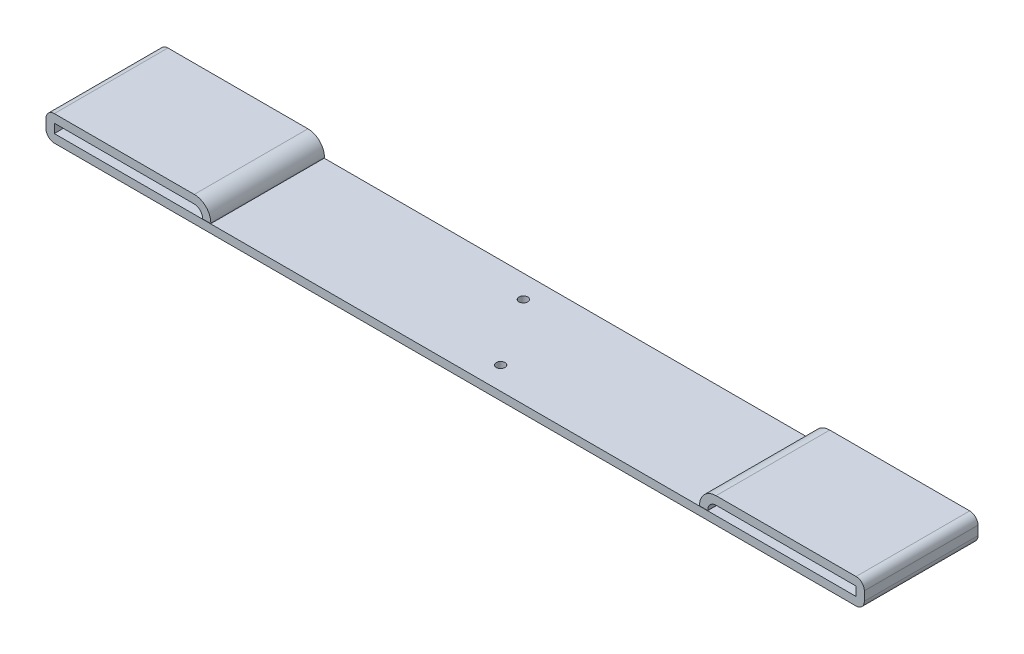
ISO-10303-21;
HEADER;
FILE_DESCRIPTION(('STEP AP214'),'2;1');
FILE_NAME('part.step','',(''),(''),'','','');
FILE_SCHEMA(('AUTOMOTIVE_DESIGN { 1 0 10303 214 1 1 1 1 }'));
ENDSEC;
DATA;
#1=APPLICATION_CONTEXT('core data for automotive mechanical design processes');
#2=APPLICATION_PROTOCOL_DEFINITION('international standard','automotive_design',2000,#1);
#3=PRODUCT_CONTEXT('',#1,'mechanical');
#4=PRODUCT('Part','Part','',(#3));
#5=PRODUCT_RELATED_PRODUCT_CATEGORY('part','',(#4));
#6=PRODUCT_DEFINITION_FORMATION('','',#4);
#7=PRODUCT_DEFINITION_CONTEXT('part definition',#1,'design');
#8=PRODUCT_DEFINITION('design','',#6,#7);
#9=PRODUCT_DEFINITION_SHAPE('','',#8);
#10=(LENGTH_UNIT() NAMED_UNIT(*) SI_UNIT(.MILLI.,.METRE.));
#11=(NAMED_UNIT(*) PLANE_ANGLE_UNIT() SI_UNIT($,.RADIAN.));
#12=(NAMED_UNIT(*) SI_UNIT($,.STERADIAN.) SOLID_ANGLE_UNIT());
#13=UNCERTAINTY_MEASURE_WITH_UNIT(LENGTH_MEASURE(1.E-05),#10,'distance_accuracy_value','');
#14=(GEOMETRIC_REPRESENTATION_CONTEXT(3) GLOBAL_UNCERTAINTY_ASSIGNED_CONTEXT((#13)) GLOBAL_UNIT_ASSIGNED_CONTEXT((#10,
#11,#12)) REPRESENTATION_CONTEXT('',''));
#15=CARTESIAN_POINT('',(0.,0.,0.));
#16=DIRECTION('',(0.,0.,1.));
#17=DIRECTION('',(1.,0.,0.));
#18=AXIS2_PLACEMENT_3D('',#15,#16,#17);
#19=CARTESIAN_POINT('',(-138.8364,0.1397,0.));
#20=DIRECTION('',(0.,1.,0.));
#21=DIRECTION('',(0.,0.,1.));
#22=AXIS2_PLACEMENT_3D('',#19,#20,#21);
#23=PLANE('',#22);
#24=DIRECTION('',(0.,0.,1.));
#25=VECTOR('',#24,1.);
#26=CARTESIAN_POINT('',(-141.1478,0.1397,-31.75));
#27=LINE('',#26,#25);
#28=CARTESIAN_POINT('',(-141.1478,0.1397,-31.75));
#29=VERTEX_POINT('',#28);
#30=CARTESIAN_POINT('',(-141.1478,0.1397,31.75));
#31=VERTEX_POINT('',#30);
#32=EDGE_CURVE('E185',#29,#31,#27,.T.);
#33=ORIENTED_EDGE('',*,*,#32,.F.);
#34=DIRECTION('',(1.,0.,0.));
#35=VECTOR('',#34,1.);
#36=CARTESIAN_POINT('',(-138.8364,0.1397,-31.75));
#37=LINE('',#36,#35);
#38=CARTESIAN_POINT('',(-136.525,0.1397,-31.75));
#39=VERTEX_POINT('',#38);
#40=EDGE_CURVE('E212',#39,#29,#37,.F.);
#41=ORIENTED_EDGE('',*,*,#40,.F.);
#42=DIRECTION('',(0.,0.,1.));
#43=VECTOR('',#42,1.);
#44=CARTESIAN_POINT('',(-136.525,0.1397,-31.75));
#45=LINE('',#44,#43);
#46=CARTESIAN_POINT('',(-136.525,0.1397,31.75));
#47=VERTEX_POINT('',#46);
#48=EDGE_CURVE('E179',#39,#47,#45,.T.);
#49=ORIENTED_EDGE('',*,*,#48,.T.);
#50=DIRECTION('',(1.,0.,0.));
#51=VECTOR('',#50,1.);
#52=CARTESIAN_POINT('',(-138.8364,0.1397,31.75));
#53=LINE('',#52,#51);
#54=EDGE_CURVE('E207',#31,#47,#53,.T.);
#55=ORIENTED_EDGE('',*,*,#54,.F.);
#56=EDGE_LOOP('',(#33,#41,#49,#55));
#57=FACE_BOUND('',#56,.T.);
#58=ADVANCED_FACE('F16',(#57),#23,.F.);
#59=CARTESIAN_POINT('',(138.8364,0.1397,0.));
#60=DIRECTION('',(0.,1.,0.));
#61=DIRECTION('',(0.,0.,1.));
#62=AXIS2_PLACEMENT_3D('',#59,#60,#61);
#63=PLANE('',#62);
#64=DIRECTION('',(0.,0.,-1.));
#65=VECTOR('',#64,1.);
#66=CARTESIAN_POINT('',(141.1478,0.1397,31.75));
#67=LINE('',#66,#65);
#68=CARTESIAN_POINT('',(141.1478,0.1397,31.75));
#69=VERTEX_POINT('',#68);
#70=CARTESIAN_POINT('',(141.1478,0.1397,-31.75));
#71=VERTEX_POINT('',#70);
#72=EDGE_CURVE('E144',#69,#71,#67,.T.);
#73=ORIENTED_EDGE('',*,*,#72,.F.);
#74=DIRECTION('',(1.,0.,0.));
#75=VECTOR('',#74,1.);
#76=CARTESIAN_POINT('',(138.8364,0.1397,31.75));
#77=LINE('',#76,#75);
#78=CARTESIAN_POINT('',(136.525,0.1397,31.75));
#79=VERTEX_POINT('',#78);
#80=EDGE_CURVE('E201',#79,#69,#77,.T.);
#81=ORIENTED_EDGE('',*,*,#80,.F.);
#82=DIRECTION('',(0.,0.,-1.));
#83=VECTOR('',#82,1.);
#84=CARTESIAN_POINT('',(136.525,0.1397,31.75));
#85=LINE('',#84,#83);
#86=CARTESIAN_POINT('',(136.525,0.1397,-31.75));
#87=VERTEX_POINT('',#86);
#88=EDGE_CURVE('E192',#79,#87,#85,.T.);
#89=ORIENTED_EDGE('',*,*,#88,.T.);
#90=DIRECTION('',(1.,0.,0.));
#91=VECTOR('',#90,1.);
#92=CARTESIAN_POINT('',(138.8364,0.1397,-31.75));
#93=LINE('',#92,#91);
#94=EDGE_CURVE('E193',#71,#87,#93,.F.);
#95=ORIENTED_EDGE('',*,*,#94,.F.);
#96=EDGE_LOOP('',(#73,#81,#89,#95));
#97=FACE_BOUND('',#96,.T.);
#98=ADVANCED_FACE('F369',(#97),#63,.F.);
#99=CARTESIAN_POINT('',(136.525,0.4191,31.75));
#100=DIRECTION('',(1.,0.,0.));
#101=DIRECTION('',(0.,0.,-1.));
#102=AXIS2_PLACEMENT_3D('',#99,#100,#101);
#103=PLANE('',#102);
#104=DIRECTION('',(0.,1.,0.));
#105=VECTOR('',#104,1.);
#106=CARTESIAN_POINT('',(136.525,0.4191,-31.75));
#107=LINE('',#106,#105);
#108=CARTESIAN_POINT('',(136.525,0.4191,-31.75));
#109=VERTEX_POINT('',#108);
#110=EDGE_CURVE('E138',#87,#109,#107,.T.);
#111=ORIENTED_EDGE('',*,*,#110,.F.);
#112=ORIENTED_EDGE('',*,*,#88,.F.);
#113=DIRECTION('',(0.,1.,0.));
#114=VECTOR('',#113,1.);
#115=CARTESIAN_POINT('',(136.525,0.4191,31.75));
#116=LINE('',#115,#114);
#117=CARTESIAN_POINT('',(136.525,0.4191,31.75));
#118=VERTEX_POINT('',#117);
#119=EDGE_CURVE('E189',#118,#79,#116,.F.);
#120=ORIENTED_EDGE('',*,*,#119,.F.);
#121=DIRECTION('',(0.,0.,-1.));
#122=VECTOR('',#121,1.);
#123=CARTESIAN_POINT('',(136.525,0.4191,31.75));
#124=LINE('',#123,#122);
#125=EDGE_CURVE('E143',#109,#118,#124,.F.);
#126=ORIENTED_EDGE('',*,*,#125,.F.);
#127=EDGE_LOOP('',(#111,#112,#120,#126));
#128=FACE_BOUND('',#127,.T.);
#129=ADVANCED_FACE('F371',(#128),#103,.F.);
#130=CARTESIAN_POINT('',(-136.525,0.4191,-31.75));
#131=DIRECTION('',(-1.,0.,0.));
#132=DIRECTION('',(0.,0.,1.));
#133=AXIS2_PLACEMENT_3D('',#130,#131,#132);
#134=PLANE('',#133);
#135=DIRECTION('',(0.,1.,0.));
#136=VECTOR('',#135,1.);
#137=CARTESIAN_POINT('',(-136.525,0.4191,31.75));
#138=LINE('',#137,#136);
#139=CARTESIAN_POINT('',(-136.525,0.4191,31.75));
#140=VERTEX_POINT('',#139);
#141=EDGE_CURVE('E182',#47,#140,#138,.T.);
#142=ORIENTED_EDGE('',*,*,#141,.F.);
#143=ORIENTED_EDGE('',*,*,#48,.F.);
#144=DIRECTION('',(0.,1.,0.));
#145=VECTOR('',#144,1.);
#146=CARTESIAN_POINT('',(-136.525,0.4191,-31.75));
#147=LINE('',#146,#145);
#148=CARTESIAN_POINT('',(-136.525,0.4191,-31.75));
#149=VERTEX_POINT('',#148);
#150=EDGE_CURVE('E176',#149,#39,#147,.F.);
#151=ORIENTED_EDGE('',*,*,#150,.F.);
#152=DIRECTION('',(0.,0.,1.));
#153=VECTOR('',#152,1.);
#154=CARTESIAN_POINT('',(-136.525,0.4191,-31.75));
#155=LINE('',#154,#153);
#156=EDGE_CURVE('E171',#140,#149,#155,.F.);
#157=ORIENTED_EDGE('',*,*,#156,.F.);
#158=EDGE_LOOP('',(#142,#143,#151,#157));
#159=FACE_BOUND('',#158,.T.);
#160=ADVANCED_FACE('F310',(#159),#134,.F.);
#161=CARTESIAN_POINT('',(-141.1478,0.4191,-31.75));
#162=DIRECTION('',(-1.,0.,0.));
#163=DIRECTION('',(0.,0.,1.));
#164=AXIS2_PLACEMENT_3D('',#161,#162,#163);
#165=PLANE('',#164);
#166=DIRECTION('',(0.,0.,1.));
#167=VECTOR('',#166,1.);
#168=CARTESIAN_POINT('',(-141.1478,0.4191,-31.75));
#169=LINE('',#168,#167);
#170=CARTESIAN_POINT('',(-141.1478,0.4191,31.75));
#171=VERTEX_POINT('',#170);
#172=CARTESIAN_POINT('',(-141.1478,0.4191,-31.75));
#173=VERTEX_POINT('',#172);
#174=EDGE_CURVE('E166',#171,#173,#169,.F.);
#175=ORIENTED_EDGE('',*,*,#174,.T.);
#176=DIRECTION('',(0.,1.,0.));
#177=VECTOR('',#176,1.);
#178=CARTESIAN_POINT('',(-141.1478,0.2794,-31.75));
#179=LINE('',#178,#177);
#180=EDGE_CURVE('E213',#173,#29,#179,.F.);
#181=ORIENTED_EDGE('',*,*,#180,.T.);
#182=ORIENTED_EDGE('',*,*,#32,.T.);
#183=DIRECTION('',(0.,1.,0.));
#184=VECTOR('',#183,1.);
#185=CARTESIAN_POINT('',(-141.1478,0.2794,31.75));
#186=LINE('',#185,#184);
#187=EDGE_CURVE('E210',#31,#171,#186,.T.);
#188=ORIENTED_EDGE('',*,*,#187,.T.);
#189=EDGE_LOOP('',(#175,#181,#182,#188));
#190=FACE_BOUND('',#189,.T.);
#191=ADVANCED_FACE('F574',(#190),#165,.T.);
#192=CARTESIAN_POINT('',(141.1478,0.4191,31.75));
#193=DIRECTION('',(1.,0.,0.));
#194=DIRECTION('',(0.,0.,-1.));
#195=AXIS2_PLACEMENT_3D('',#192,#193,#194);
#196=PLANE('',#195);
#197=DIRECTION('',(0.,0.,-1.));
#198=VECTOR('',#197,1.);
#199=CARTESIAN_POINT('',(141.1478,0.4191,31.75));
#200=LINE('',#199,#198);
#201=CARTESIAN_POINT('',(141.1478,0.4191,-31.75));
#202=VERTEX_POINT('',#201);
#203=CARTESIAN_POINT('',(141.1478,0.4191,31.75));
#204=VERTEX_POINT('',#203);
#205=EDGE_CURVE('E157',#202,#204,#200,.F.);
#206=ORIENTED_EDGE('',*,*,#205,.T.);
#207=DIRECTION('',(0.,1.,0.));
#208=VECTOR('',#207,1.);
#209=CARTESIAN_POINT('',(141.1478,0.2794,31.75));
#210=LINE('',#209,#208);
#211=EDGE_CURVE('E202',#204,#69,#210,.F.);
#212=ORIENTED_EDGE('',*,*,#211,.T.);
#213=ORIENTED_EDGE('',*,*,#72,.T.);
#214=DIRECTION('',(0.,1.,0.));
#215=VECTOR('',#214,1.);
#216=CARTESIAN_POINT('',(141.1478,0.2794,-31.75));
#217=LINE('',#216,#215);
#218=EDGE_CURVE('E199',#71,#202,#217,.T.);
#219=ORIENTED_EDGE('',*,*,#218,.T.);
#220=EDGE_LOOP('',(#206,#212,#213,#219));
#221=FACE_BOUND('',#220,.T.);
#222=ADVANCED_FACE('F362',(#221),#196,.T.);
#223=CARTESIAN_POINT('',(145.7706,0.4191,31.75));
#224=DIRECTION('',(0.,0.,-1.));
#225=DIRECTION('',(-1.,0.,0.));
#226=AXIS2_PLACEMENT_3D('',#223,#224,#225);
#227=CYLINDRICAL_SURFACE('',#226,9.2456);
#228=ORIENTED_EDGE('',*,*,#125,.T.);
#229=CARTESIAN_POINT('',(145.7706,0.4191,31.75));
#230=DIRECTION('',(0.,0.,-1.));
#231=DIRECTION('',(-1.,0.,0.));
#232=AXIS2_PLACEMENT_3D('',#229,#230,#231);
#233=CIRCLE('',#232,9.2456);
#234=CARTESIAN_POINT('',(145.7706,9.6647,31.75));
#235=VERTEX_POINT('',#234);
#236=EDGE_CURVE('E156',#118,#235,#233,.T.);
#237=ORIENTED_EDGE('',*,*,#236,.T.);
#238=DIRECTION('',(0.,0.,-1.));
#239=VECTOR('',#238,1.);
#240=CARTESIAN_POINT('',(145.7706,9.6647,31.75));
#241=LINE('',#240,#239);
#242=CARTESIAN_POINT('',(145.7706,9.6647,-31.75));
#243=VERTEX_POINT('',#242);
#244=EDGE_CURVE('E148',#235,#243,#241,.T.);
#245=ORIENTED_EDGE('',*,*,#244,.T.);
#246=CARTESIAN_POINT('',(145.7706,0.4191,-31.75));
#247=DIRECTION('',(0.,0.,-1.));
#248=DIRECTION('',(-1.,0.,0.));
#249=AXIS2_PLACEMENT_3D('',#246,#247,#248);
#250=CIRCLE('',#249,9.2456);
#251=EDGE_CURVE('E19',#243,#109,#250,.F.);
#252=ORIENTED_EDGE('',*,*,#251,.T.);
#253=EDGE_LOOP('',(#228,#237,#245,#252));
#254=FACE_BOUND('',#253,.T.);
#255=ADVANCED_FACE('F154',(#254),#227,.T.);
#256=CARTESIAN_POINT('',(-145.7706,0.4191,-31.75));
#257=DIRECTION('',(0.,0.,1.));
#258=DIRECTION('',(1.,0.,0.));
#259=AXIS2_PLACEMENT_3D('',#256,#257,#258);
#260=CYLINDRICAL_SURFACE('',#259,9.2456);
#261=ORIENTED_EDGE('',*,*,#156,.T.);
#262=CARTESIAN_POINT('',(-145.7706,0.4191,-31.75));
#263=DIRECTION('',(0.,0.,1.));
#264=DIRECTION('',(1.,0.,0.));
#265=AXIS2_PLACEMENT_3D('',#262,#263,#264);
#266=CIRCLE('',#265,9.2456);
#267=CARTESIAN_POINT('',(-145.7706,9.6647,-31.75));
#268=VERTEX_POINT('',#267);
#269=EDGE_CURVE('E174',#149,#268,#266,.T.);
#270=ORIENTED_EDGE('',*,*,#269,.T.);
#271=DIRECTION('',(0.,0.,-1.));
#272=VECTOR('',#271,1.);
#273=CARTESIAN_POINT('',(-145.7706,9.6647,-31.75));
#274=LINE('',#273,#272);
#275=CARTESIAN_POINT('',(-145.7706,9.6647,31.75));
#276=VERTEX_POINT('',#275);
#277=EDGE_CURVE('E163',#268,#276,#274,.F.);
#278=ORIENTED_EDGE('',*,*,#277,.T.);
#279=CARTESIAN_POINT('',(-145.7706,0.4191,31.75));
#280=DIRECTION('',(0.,0.,1.));
#281=DIRECTION('',(1.,0.,0.));
#282=AXIS2_PLACEMENT_3D('',#279,#280,#281);
#283=CIRCLE('',#282,9.2456);
#284=EDGE_CURVE('E175',#276,#140,#283,.F.);
#285=ORIENTED_EDGE('',*,*,#284,.T.);
#286=EDGE_LOOP('',(#261,#270,#278,#285));
#287=FACE_BOUND('',#286,.T.);
#288=ADVANCED_FACE('F296',(#287),#260,.T.);
#289=CARTESIAN_POINT('',(-145.7706,0.4191,-31.75));
#290=DIRECTION('',(0.,0.,1.));
#291=DIRECTION('',(1.,0.,0.));
#292=AXIS2_PLACEMENT_3D('',#289,#290,#291);
#293=CYLINDRICAL_SURFACE('',#292,4.6228);
#294=CARTESIAN_POINT('',(-145.7706,0.4191,31.75));
#295=DIRECTION('',(0.,0.,1.));
#296=DIRECTION('',(1.,0.,0.));
#297=AXIS2_PLACEMENT_3D('',#294,#295,#296);
#298=CIRCLE('',#297,4.6228);
#299=CARTESIAN_POINT('',(-145.7706,5.0419,31.75));
#300=VERTEX_POINT('',#299);
#301=EDGE_CURVE('E170',#300,#171,#298,.F.);
#302=ORIENTED_EDGE('',*,*,#301,.F.);
#303=DIRECTION('',(0.,0.,-1.));
#304=VECTOR('',#303,1.);
#305=CARTESIAN_POINT('',(-145.7706,5.0419,-31.75));
#306=LINE('',#305,#304);
#307=CARTESIAN_POINT('',(-145.7706,5.0419,-31.75));
#308=VERTEX_POINT('',#307);
#309=EDGE_CURVE('E381',#308,#300,#306,.F.);
#310=ORIENTED_EDGE('',*,*,#309,.F.);
#311=CARTESIAN_POINT('',(-145.7706,0.4191,-31.75));
#312=DIRECTION('',(0.,0.,1.));
#313=DIRECTION('',(1.,0.,0.));
#314=AXIS2_PLACEMENT_3D('',#311,#312,#313);
#315=CIRCLE('',#314,4.6228);
#316=EDGE_CURVE('E290',#173,#308,#315,.T.);
#317=ORIENTED_EDGE('',*,*,#316,.F.);
#318=ORIENTED_EDGE('',*,*,#174,.F.);
#319=EDGE_LOOP('',(#302,#310,#317,#318));
#320=FACE_BOUND('',#319,.T.);
#321=ADVANCED_FACE('F563',(#320),#293,.F.);
#322=CARTESIAN_POINT('',(145.7706,0.4191,31.75));
#323=DIRECTION('',(0.,0.,-1.));
#324=DIRECTION('',(-1.,0.,0.));
#325=AXIS2_PLACEMENT_3D('',#322,#323,#324);
#326=CYLINDRICAL_SURFACE('',#325,4.6228);
#327=CARTESIAN_POINT('',(145.7706,0.4191,-31.75));
#328=DIRECTION('',(0.,0.,-1.));
#329=DIRECTION('',(-1.,0.,0.));
#330=AXIS2_PLACEMENT_3D('',#327,#328,#329);
#331=CIRCLE('',#330,4.6228);
#332=CARTESIAN_POINT('',(145.7706,5.0419,-31.75));
#333=VERTEX_POINT('',#332);
#334=EDGE_CURVE('E160',#333,#202,#331,.F.);
#335=ORIENTED_EDGE('',*,*,#334,.F.);
#336=DIRECTION('',(0.,0.,-1.));
#337=VECTOR('',#336,1.);
#338=CARTESIAN_POINT('',(145.7706,5.0419,31.75));
#339=LINE('',#338,#337);
#340=CARTESIAN_POINT('',(145.7706,5.0419,31.75));
#341=VERTEX_POINT('',#340);
#342=EDGE_CURVE('E283',#341,#333,#339,.T.);
#343=ORIENTED_EDGE('',*,*,#342,.F.);
#344=CARTESIAN_POINT('',(145.7706,0.4191,31.75));
#345=DIRECTION('',(0.,0.,-1.));
#346=DIRECTION('',(-1.,0.,0.));
#347=AXIS2_PLACEMENT_3D('',#344,#345,#346);
#348=CIRCLE('',#347,4.6228);
#349=EDGE_CURVE('E169',#204,#341,#348,.T.);
#350=ORIENTED_EDGE('',*,*,#349,.F.);
#351=ORIENTED_EDGE('',*,*,#205,.F.);
#352=EDGE_LOOP('',(#335,#343,#350,#351));
#353=FACE_BOUND('',#352,.T.);
#354=ADVANCED_FACE('F560',(#353),#326,.F.);
#355=CARTESIAN_POINT('',(223.9772,9.6647,31.75));
#356=DIRECTION('',(0.,-1.,0.));
#357=DIRECTION('',(0.,0.,-1.));
#358=AXIS2_PLACEMENT_3D('',#355,#356,#357);
#359=PLANE('',#358);
#360=DIRECTION('',(0.,0.,-1.));
#361=VECTOR('',#360,1.);
#362=CARTESIAN_POINT('',(223.9772,9.6647,31.75));
#363=LINE('',#362,#361);
#364=CARTESIAN_POINT('',(223.9772,9.6647,-31.75));
#365=VERTEX_POINT('',#364);
#366=CARTESIAN_POINT('',(223.9772,9.6647,31.75));
#367=VERTEX_POINT('',#366);
#368=EDGE_CURVE('E151',#365,#367,#363,.F.);
#369=ORIENTED_EDGE('',*,*,#368,.F.);
#370=DIRECTION('',(1.,0.,0.));
#371=VECTOR('',#370,1.);
#372=CARTESIAN_POINT('',(223.9772,9.6647,-31.75));
#373=LINE('',#372,#371);
#374=EDGE_CURVE('E134',#243,#365,#373,.T.);
#375=ORIENTED_EDGE('',*,*,#374,.F.);
#376=ORIENTED_EDGE('',*,*,#244,.F.);
#377=DIRECTION('',(1.,0.,0.));
#378=VECTOR('',#377,1.);
#379=CARTESIAN_POINT('',(223.9772,9.6647,31.75));
#380=LINE('',#379,#378);
#381=EDGE_CURVE('E152',#367,#235,#380,.F.);
#382=ORIENTED_EDGE('',*,*,#381,.F.);
#383=EDGE_LOOP('',(#369,#375,#376,#382));
#384=FACE_BOUND('',#383,.T.);
#385=ADVANCED_FACE('F147',(#384),#359,.F.);
#386=CARTESIAN_POINT('',(-223.9772,9.6647,-31.75));
#387=DIRECTION('',(0.,-1.,0.));
#388=DIRECTION('',(0.,0.,-1.));
#389=AXIS2_PLACEMENT_3D('',#386,#387,#388);
#390=PLANE('',#389);
#391=DIRECTION('',(0.,0.,1.));
#392=VECTOR('',#391,1.);
#393=CARTESIAN_POINT('',(-223.9772,9.6647,-31.75));
#394=LINE('',#393,#392);
#395=CARTESIAN_POINT('',(-223.9772,9.6647,31.75));
#396=VERTEX_POINT('',#395);
#397=CARTESIAN_POINT('',(-223.9772,9.6647,-31.75));
#398=VERTEX_POINT('',#397);
#399=EDGE_CURVE('E276',#396,#398,#394,.F.);
#400=ORIENTED_EDGE('',*,*,#399,.F.);
#401=DIRECTION('',(1.,0.,0.));
#402=VECTOR('',#401,1.);
#403=CARTESIAN_POINT('',(-223.9772,9.6647,31.75));
#404=LINE('',#403,#402);
#405=EDGE_CURVE('E375',#276,#396,#404,.F.);
#406=ORIENTED_EDGE('',*,*,#405,.F.);
#407=ORIENTED_EDGE('',*,*,#277,.F.);
#408=DIRECTION('',(1.,0.,0.));
#409=VECTOR('',#408,1.);
#410=CARTESIAN_POINT('',(-223.9772,9.6647,-31.75));
#411=LINE('',#410,#409);
#412=EDGE_CURVE('E393',#398,#268,#411,.T.);
#413=ORIENTED_EDGE('',*,*,#412,.F.);
#414=EDGE_LOOP('',(#400,#406,#407,#413));
#415=FACE_BOUND('',#414,.T.);
#416=ADVANCED_FACE('F405',(#415),#390,.F.);
#417=CARTESIAN_POINT('',(-223.9772,5.0419,-31.75));
#418=DIRECTION('',(0.,-1.,0.));
#419=DIRECTION('',(0.,0.,-1.));
#420=AXIS2_PLACEMENT_3D('',#417,#418,#419);
#421=PLANE('',#420);
#422=DIRECTION('',(1.,0.,0.));
#423=VECTOR('',#422,1.);
#424=CARTESIAN_POINT('',(-223.9772,5.0419,-31.75));
#425=LINE('',#424,#423);
#426=CARTESIAN_POINT('',(-223.9772,5.0419,-31.75));
#427=VERTEX_POINT('',#426);
#428=EDGE_CURVE('E384',#427,#308,#425,.T.);
#429=ORIENTED_EDGE('',*,*,#428,.T.);
#430=ORIENTED_EDGE('',*,*,#309,.T.);
#431=DIRECTION('',(1.,0.,0.));
#432=VECTOR('',#431,1.);
#433=CARTESIAN_POINT('',(-223.9772,5.0419,31.75));
#434=LINE('',#433,#432);
#435=CARTESIAN_POINT('',(-223.9772,5.0419,31.75));
#436=VERTEX_POINT('',#435);
#437=EDGE_CURVE('E389',#300,#436,#434,.F.);
#438=ORIENTED_EDGE('',*,*,#437,.T.);
#439=DIRECTION('',(0.,0.,-1.));
#440=VECTOR('',#439,1.);
#441=CARTESIAN_POINT('',(-223.9772,5.0419,-31.75));
#442=LINE('',#441,#440);
#443=EDGE_CURVE('E444',#427,#436,#442,.F.);
#444=ORIENTED_EDGE('',*,*,#443,.F.);
#445=EDGE_LOOP('',(#429,#430,#438,#444));
#446=FACE_BOUND('',#445,.T.);
#447=ADVANCED_FACE('F549',(#446),#421,.T.);
#448=CARTESIAN_POINT('',(223.9772,5.0419,31.75));
#449=DIRECTION('',(0.,-1.,0.));
#450=DIRECTION('',(0.,0.,-1.));
#451=AXIS2_PLACEMENT_3D('',#448,#449,#450);
#452=PLANE('',#451);
#453=DIRECTION('',(1.,0.,0.));
#454=VECTOR('',#453,1.);
#455=CARTESIAN_POINT('',(223.9772,5.0419,31.75));
#456=LINE('',#455,#454);
#457=CARTESIAN_POINT('',(223.9772,5.0419,31.75));
#458=VERTEX_POINT('',#457);
#459=EDGE_CURVE('E380',#458,#341,#456,.F.);
#460=ORIENTED_EDGE('',*,*,#459,.T.);
#461=ORIENTED_EDGE('',*,*,#342,.T.);
#462=DIRECTION('',(1.,0.,0.));
#463=VECTOR('',#462,1.);
#464=CARTESIAN_POINT('',(223.9772,5.0419,-31.75));
#465=LINE('',#464,#463);
#466=CARTESIAN_POINT('',(223.9772,5.0419,-31.75));
#467=VERTEX_POINT('',#466);
#468=EDGE_CURVE('E383',#333,#467,#465,.T.);
#469=ORIENTED_EDGE('',*,*,#468,.T.);
#470=DIRECTION('',(0.,0.,1.));
#471=VECTOR('',#470,1.);
#472=CARTESIAN_POINT('',(223.9772,5.0419,31.75));
#473=LINE('',#472,#471);
#474=EDGE_CURVE('E435',#458,#467,#473,.F.);
#475=ORIENTED_EDGE('',*,*,#474,.F.);
#476=EDGE_LOOP('',(#460,#461,#469,#475));
#477=FACE_BOUND('',#476,.T.);
#478=ADVANCED_FACE('F542',(#477),#452,.T.);
#479=CARTESIAN_POINT('',(223.9772,5.0419,31.75));
#480=DIRECTION('',(0.,0.,-1.));
#481=DIRECTION('',(-1.,0.,0.));
#482=AXIS2_PLACEMENT_3D('',#479,#480,#481);
#483=CYLINDRICAL_SURFACE('',#482,4.6228);
#484=ORIENTED_EDGE('',*,*,#368,.T.);
#485=CARTESIAN_POINT('',(223.9772,5.0419,31.75));
#486=DIRECTION('',(0.,0.,-1.));
#487=DIRECTION('',(-1.,0.,0.));
#488=AXIS2_PLACEMENT_3D('',#485,#486,#487);
#489=CIRCLE('',#488,4.6228);
#490=CARTESIAN_POINT('',(228.6,5.0419,31.75));
#491=VERTEX_POINT('',#490);
#492=EDGE_CURVE('E279',#367,#491,#489,.T.);
#493=ORIENTED_EDGE('',*,*,#492,.T.);
#494=DIRECTION('',(0.,0.,1.));
#495=VECTOR('',#494,1.);
#496=CARTESIAN_POINT('',(228.6,5.0419,31.75));
#497=LINE('',#496,#495);
#498=CARTESIAN_POINT('',(228.6,5.0419,-31.75));
#499=VERTEX_POINT('',#498);
#500=EDGE_CURVE('E433',#491,#499,#497,.F.);
#501=ORIENTED_EDGE('',*,*,#500,.T.);
#502=CARTESIAN_POINT('',(223.9772,5.0419,-31.75));
#503=DIRECTION('',(0.,0.,-1.));
#504=DIRECTION('',(-1.,0.,0.));
#505=AXIS2_PLACEMENT_3D('',#502,#503,#504);
#506=CIRCLE('',#505,4.6228);
#507=EDGE_CURVE('E281',#499,#365,#506,.F.);
#508=ORIENTED_EDGE('',*,*,#507,.T.);
#509=EDGE_LOOP('',(#484,#493,#501,#508));
#510=FACE_BOUND('',#509,.T.);
#511=ADVANCED_FACE('F540',(#510),#483,.T.);
#512=CARTESIAN_POINT('',(-223.9772,5.0419,-31.75));
#513=DIRECTION('',(0.,0.,1.));
#514=DIRECTION('',(1.,0.,0.));
#515=AXIS2_PLACEMENT_3D('',#512,#513,#514);
#516=CYLINDRICAL_SURFACE('',#515,4.6228);
#517=ORIENTED_EDGE('',*,*,#399,.T.);
#518=CARTESIAN_POINT('',(-223.9772,5.0419,-31.75));
#519=DIRECTION('',(0.,0.,1.));
#520=DIRECTION('',(1.,0.,0.));
#521=AXIS2_PLACEMENT_3D('',#518,#519,#520);
#522=CIRCLE('',#521,4.6228);
#523=CARTESIAN_POINT('',(-228.6,5.0419,-31.75));
#524=VERTEX_POINT('',#523);
#525=EDGE_CURVE('E273',#398,#524,#522,.T.);
#526=ORIENTED_EDGE('',*,*,#525,.T.);
#527=DIRECTION('',(0.,0.,-1.));
#528=VECTOR('',#527,1.);
#529=CARTESIAN_POINT('',(-228.6,5.0419,-31.75));
#530=LINE('',#529,#528);
#531=CARTESIAN_POINT('',(-228.6,5.0419,31.75));
#532=VERTEX_POINT('',#531);
#533=EDGE_CURVE('E417',#524,#532,#530,.F.);
#534=ORIENTED_EDGE('',*,*,#533,.T.);
#535=CARTESIAN_POINT('',(-223.9772,5.0419,31.75));
#536=DIRECTION('',(0.,0.,1.));
#537=DIRECTION('',(1.,0.,0.));
#538=AXIS2_PLACEMENT_3D('',#535,#536,#537);
#539=CIRCLE('',#538,4.6228);
#540=EDGE_CURVE('E277',#532,#396,#539,.F.);
#541=ORIENTED_EDGE('',*,*,#540,.T.);
#542=EDGE_LOOP('',(#517,#526,#534,#541));
#543=FACE_BOUND('',#542,.T.);
#544=ADVANCED_FACE('F408',(#543),#516,.T.);
#545=CARTESIAN_POINT('',(-223.9772,0.,-31.75));
#546=DIRECTION('',(1.,0.,0.));
#547=DIRECTION('',(0.,0.,-1.));
#548=AXIS2_PLACEMENT_3D('',#545,#546,#547);
#549=PLANE('',#548);
#550=DIRECTION('',(0.,1.,0.));
#551=VECTOR('',#550,1.);
#552=CARTESIAN_POINT('',(-223.9772,0.,31.75));
#553=LINE('',#552,#551);
#554=CARTESIAN_POINT('',(-223.9772,0.,31.75));
#555=VERTEX_POINT('',#554);
#556=EDGE_CURVE('E440',#436,#555,#553,.F.);
#557=ORIENTED_EDGE('',*,*,#556,.T.);
#558=DIRECTION('',(0.,0.,1.));
#559=VECTOR('',#558,1.);
#560=CARTESIAN_POINT('',(-223.9772,0.,-31.75));
#561=LINE('',#560,#559);
#562=CARTESIAN_POINT('',(-223.9772,0.,-31.75));
#563=VERTEX_POINT('',#562);
#564=EDGE_CURVE('E412',#563,#555,#561,.T.);
#565=ORIENTED_EDGE('',*,*,#564,.F.);
#566=DIRECTION('',(0.,1.,0.));
#567=VECTOR('',#566,1.);
#568=CARTESIAN_POINT('',(-223.9772,0.,-31.75));
#569=LINE('',#568,#567);
#570=EDGE_CURVE('E275',#563,#427,#569,.T.);
#571=ORIENTED_EDGE('',*,*,#570,.T.);
#572=ORIENTED_EDGE('',*,*,#443,.T.);
#573=EDGE_LOOP('',(#557,#565,#571,#572));
#574=FACE_BOUND('',#573,.T.);
#575=ADVANCED_FACE('F467',(#574),#549,.T.);
#576=CARTESIAN_POINT('',(223.9772,0.,31.75));
#577=DIRECTION('',(-1.,0.,0.));
#578=DIRECTION('',(0.,0.,1.));
#579=AXIS2_PLACEMENT_3D('',#576,#577,#578);
#580=PLANE('',#579);
#581=DIRECTION('',(0.,1.,0.));
#582=VECTOR('',#581,1.);
#583=CARTESIAN_POINT('',(223.9772,0.,31.75));
#584=LINE('',#583,#582);
#585=CARTESIAN_POINT('',(223.9772,0.,31.75));
#586=VERTEX_POINT('',#585);
#587=EDGE_CURVE('E339',#586,#458,#584,.T.);
#588=ORIENTED_EDGE('',*,*,#587,.T.);
#589=ORIENTED_EDGE('',*,*,#474,.T.);
#590=DIRECTION('',(0.,1.,0.));
#591=VECTOR('',#590,1.);
#592=CARTESIAN_POINT('',(223.9772,0.,-31.75));
#593=LINE('',#592,#591);
#594=CARTESIAN_POINT('',(223.9772,0.,-31.75));
#595=VERTEX_POINT('',#594);
#596=EDGE_CURVE('E436',#467,#595,#593,.F.);
#597=ORIENTED_EDGE('',*,*,#596,.T.);
#598=DIRECTION('',(0.,0.,1.));
#599=VECTOR('',#598,1.);
#600=CARTESIAN_POINT('',(223.9772,0.,-31.75));
#601=LINE('',#600,#599);
#602=EDGE_CURVE('E272',#586,#595,#601,.F.);
#603=ORIENTED_EDGE('',*,*,#602,.F.);
#604=EDGE_LOOP('',(#588,#589,#597,#603));
#605=FACE_BOUND('',#604,.T.);
#606=ADVANCED_FACE('F502',(#605),#580,.T.);
#607=CARTESIAN_POINT('',(228.6,0.,31.75));
#608=DIRECTION('',(-1.,0.,0.));
#609=DIRECTION('',(0.,0.,1.));
#610=AXIS2_PLACEMENT_3D('',#607,#608,#609);
#611=PLANE('',#610);
#612=DIRECTION('',(0.,0.,-1.));
#613=VECTOR('',#612,1.);
#614=CARTESIAN_POINT('',(228.6,0.,31.75));
#615=LINE('',#614,#613);
#616=CARTESIAN_POINT('',(228.6,0.,-31.75));
#617=VERTEX_POINT('',#616);
#618=CARTESIAN_POINT('',(228.6,0.,31.75));
#619=VERTEX_POINT('',#618);
#620=EDGE_CURVE('E269',#617,#619,#615,.F.);
#621=ORIENTED_EDGE('',*,*,#620,.F.);
#622=DIRECTION('',(0.,1.,0.));
#623=VECTOR('',#622,1.);
#624=CARTESIAN_POINT('',(228.6,0.,-31.75));
#625=LINE('',#624,#623);
#626=EDGE_CURVE('E430',#499,#617,#625,.F.);
#627=ORIENTED_EDGE('',*,*,#626,.F.);
#628=ORIENTED_EDGE('',*,*,#500,.F.);
#629=DIRECTION('',(0.,1.,0.));
#630=VECTOR('',#629,1.);
#631=CARTESIAN_POINT('',(228.6,0.,31.75));
#632=LINE('',#631,#630);
#633=EDGE_CURVE('E428',#619,#491,#632,.T.);
#634=ORIENTED_EDGE('',*,*,#633,.F.);
#635=EDGE_LOOP('',(#621,#627,#628,#634));
#636=FACE_BOUND('',#635,.T.);
#637=ADVANCED_FACE('F492',(#636),#611,.F.);
#638=CARTESIAN_POINT('',(-228.6,0.,-31.75));
#639=DIRECTION('',(1.,0.,0.));
#640=DIRECTION('',(0.,0.,-1.));
#641=AXIS2_PLACEMENT_3D('',#638,#639,#640);
#642=PLANE('',#641);
#643=DIRECTION('',(0.,0.,1.));
#644=VECTOR('',#643,1.);
#645=CARTESIAN_POINT('',(-228.6,0.,-31.75));
#646=LINE('',#645,#644);
#647=CARTESIAN_POINT('',(-228.6,0.,31.75));
#648=VERTEX_POINT('',#647);
#649=CARTESIAN_POINT('',(-228.6,0.,-31.75));
#650=VERTEX_POINT('',#649);
#651=EDGE_CURVE('E264',#648,#650,#646,.F.);
#652=ORIENTED_EDGE('',*,*,#651,.F.);
#653=DIRECTION('',(0.,1.,0.));
#654=VECTOR('',#653,1.);
#655=CARTESIAN_POINT('',(-228.6,0.,31.75));
#656=LINE('',#655,#654);
#657=EDGE_CURVE('E413',#532,#648,#656,.F.);
#658=ORIENTED_EDGE('',*,*,#657,.F.);
#659=ORIENTED_EDGE('',*,*,#533,.F.);
#660=DIRECTION('',(0.,1.,0.));
#661=VECTOR('',#660,1.);
#662=CARTESIAN_POINT('',(-228.6,0.,-31.75));
#663=LINE('',#662,#661);
#664=EDGE_CURVE('E333',#650,#524,#663,.T.);
#665=ORIENTED_EDGE('',*,*,#664,.F.);
#666=EDGE_LOOP('',(#652,#658,#659,#665));
#667=FACE_BOUND('',#666,.T.);
#668=ADVANCED_FACE('F489',(#667),#642,.F.);
#669=CARTESIAN_POINT('',(228.6,0.,-31.75));
#670=DIRECTION('',(0.,1.,0.));
#671=DIRECTION('',(0.,0.,1.));
#672=AXIS2_PLACEMENT_3D('',#669,#670,#671);
#673=PLANE('',#672);
#674=CARTESIAN_POINT('',(12.7,0.,19.05));
#675=DIRECTION('',(0.,-1.,0.));
#676=DIRECTION('',(0.,0.,-1.));
#677=AXIS2_PLACEMENT_3D('',#674,#675,#676);
#678=CIRCLE('',#677,2.4384);
#679=CARTESIAN_POINT('',(12.7,0.,16.6116));
#680=VERTEX_POINT('',#679);
#681=EDGE_CURVE('E254',#680,#680,#678,.T.);
#682=ORIENTED_EDGE('',*,*,#681,.T.);
#683=EDGE_LOOP('',(#682));
#684=FACE_BOUND('',#683,.T.);
#685=CARTESIAN_POINT('',(-12.7,0.,-19.05));
#686=DIRECTION('',(0.,-1.,0.));
#687=DIRECTION('',(0.,0.,-1.));
#688=AXIS2_PLACEMENT_3D('',#685,#686,#687);
#689=CIRCLE('',#688,2.4384);
#690=CARTESIAN_POINT('',(-12.7,0.,-21.4884));
#691=VERTEX_POINT('',#690);
#692=EDGE_CURVE('E258',#691,#691,#689,.T.);
#693=ORIENTED_EDGE('',*,*,#692,.T.);
#694=EDGE_LOOP('',(#693));
#695=FACE_BOUND('',#694,.T.);
#696=DIRECTION('',(-1.,0.,0.));
#697=VECTOR('',#696,1.);
#698=CARTESIAN_POINT('',(0.,0.,31.75));
#699=LINE('',#698,#697);
#700=EDGE_CURVE('E261',#555,#586,#699,.F.);
#701=ORIENTED_EDGE('',*,*,#700,.T.);
#702=ORIENTED_EDGE('',*,*,#602,.T.);
#703=DIRECTION('',(-1.,0.,0.));
#704=VECTOR('',#703,1.);
#705=CARTESIAN_POINT('',(0.,0.,-31.75));
#706=LINE('',#705,#704);
#707=EDGE_CURVE('E266',#563,#595,#706,.F.);
#708=ORIENTED_EDGE('',*,*,#707,.F.);
#709=ORIENTED_EDGE('',*,*,#564,.T.);
#710=EDGE_LOOP('',(#701,#702,#708,#709));
#711=FACE_BOUND('',#710,.T.);
#712=ADVANCED_FACE('F491',(#684,#695,#711),#673,.T.);
#713=CARTESIAN_POINT('',(223.9772,0.,31.75));
#714=DIRECTION('',(0.,0.,-1.));
#715=DIRECTION('',(-1.,0.,0.));
#716=AXIS2_PLACEMENT_3D('',#713,#714,#715);
#717=CYLINDRICAL_SURFACE('',#716,4.6228);
#718=ORIENTED_EDGE('',*,*,#620,.T.);
#719=CARTESIAN_POINT('',(223.9772,0.,31.75));
#720=DIRECTION('',(0.,0.,-1.));
#721=DIRECTION('',(-1.,0.,0.));
#722=AXIS2_PLACEMENT_3D('',#719,#720,#721);
#723=CIRCLE('',#722,4.6228);
#724=CARTESIAN_POINT('',(223.9772,-4.6228,31.75));
#725=VERTEX_POINT('',#724);
#726=EDGE_CURVE('E267',#619,#725,#723,.T.);
#727=ORIENTED_EDGE('',*,*,#726,.T.);
#728=DIRECTION('',(0.,0.,1.));
#729=VECTOR('',#728,1.);
#730=CARTESIAN_POINT('',(223.9772,-4.6228,-31.75));
#731=LINE('',#730,#729);
#732=CARTESIAN_POINT('',(223.9772,-4.6228,-31.75));
#733=VERTEX_POINT('',#732);
#734=EDGE_CURVE('E257',#725,#733,#731,.F.);
#735=ORIENTED_EDGE('',*,*,#734,.T.);
#736=CARTESIAN_POINT('',(223.9772,0.,-31.75));
#737=DIRECTION('',(0.,0.,-1.));
#738=DIRECTION('',(-1.,0.,0.));
#739=AXIS2_PLACEMENT_3D('',#736,#737,#738);
#740=CIRCLE('',#739,4.6228);
#741=EDGE_CURVE('E270',#733,#617,#740,.F.);
#742=ORIENTED_EDGE('',*,*,#741,.T.);
#743=EDGE_LOOP('',(#718,#727,#735,#742));
#744=FACE_BOUND('',#743,.T.);
#745=ADVANCED_FACE('F499',(#744),#717,.T.);
#746=CARTESIAN_POINT('',(0.,-2.3114,-31.75));
#747=DIRECTION('',(0.,0.,-1.));
#748=DIRECTION('',(-1.,0.,0.));
#749=AXIS2_PLACEMENT_3D('',#746,#747,#748);
#750=PLANE('',#749);
#751=ORIENTED_EDGE('',*,*,#707,.T.);
#752=ORIENTED_EDGE('',*,*,#596,.F.);
#753=ORIENTED_EDGE('',*,*,#468,.F.);
#754=ORIENTED_EDGE('',*,*,#334,.T.);
#755=ORIENTED_EDGE('',*,*,#218,.F.);
#756=ORIENTED_EDGE('',*,*,#94,.T.);
#757=ORIENTED_EDGE('',*,*,#110,.T.);
#758=ORIENTED_EDGE('',*,*,#251,.F.);
#759=ORIENTED_EDGE('',*,*,#374,.T.);
#760=ORIENTED_EDGE('',*,*,#507,.F.);
#761=ORIENTED_EDGE('',*,*,#626,.T.);
#762=ORIENTED_EDGE('',*,*,#741,.F.);
#763=DIRECTION('',(1.,0.,0.));
#764=VECTOR('',#763,1.);
#765=CARTESIAN_POINT('',(228.6,-4.6228,-31.75));
#766=LINE('',#765,#764);
#767=CARTESIAN_POINT('',(-223.9772,-4.6228,-31.75));
#768=VERTEX_POINT('',#767);
#769=EDGE_CURVE('E420',#733,#768,#766,.F.);
#770=ORIENTED_EDGE('',*,*,#769,.T.);
#771=CARTESIAN_POINT('',(-223.9772,0.,-31.75));
#772=DIRECTION('',(0.,0.,1.));
#773=DIRECTION('',(1.,0.,0.));
#774=AXIS2_PLACEMENT_3D('',#771,#772,#773);
#775=CIRCLE('',#774,4.6228);
#776=EDGE_CURVE('E262',#650,#768,#775,.T.);
#777=ORIENTED_EDGE('',*,*,#776,.F.);
#778=ORIENTED_EDGE('',*,*,#664,.T.);
#779=ORIENTED_EDGE('',*,*,#525,.F.);
#780=ORIENTED_EDGE('',*,*,#412,.T.);
#781=ORIENTED_EDGE('',*,*,#269,.F.);
#782=ORIENTED_EDGE('',*,*,#150,.T.);
#783=ORIENTED_EDGE('',*,*,#40,.T.);
#784=ORIENTED_EDGE('',*,*,#180,.F.);
#785=ORIENTED_EDGE('',*,*,#316,.T.);
#786=ORIENTED_EDGE('',*,*,#428,.F.);
#787=ORIENTED_EDGE('',*,*,#570,.F.);
#788=EDGE_LOOP('',(#751,#752,#753,#754,#755,#756,#757,#758,#759,#760,#761,#762,#770,#777,#778,
#779,#780,#781,#782,#783,#784,#785,#786,#787));
#789=FACE_BOUND('',#788,.T.);
#790=ADVANCED_FACE('F133',(#789),#750,.T.);
#791=CARTESIAN_POINT('',(-223.9772,0.,-31.75));
#792=DIRECTION('',(0.,0.,1.));
#793=DIRECTION('',(1.,0.,0.));
#794=AXIS2_PLACEMENT_3D('',#791,#792,#793);
#795=CYLINDRICAL_SURFACE('',#794,4.6228);
#796=ORIENTED_EDGE('',*,*,#651,.T.);
#797=ORIENTED_EDGE('',*,*,#776,.T.);
#798=DIRECTION('',(0.,0.,1.));
#799=VECTOR('',#798,1.);
#800=CARTESIAN_POINT('',(-223.9772,-4.6228,-31.75));
#801=LINE('',#800,#799);
#802=CARTESIAN_POINT('',(-223.9772,-4.6228,31.75));
#803=VERTEX_POINT('',#802);
#804=EDGE_CURVE('E475',#768,#803,#801,.T.);
#805=ORIENTED_EDGE('',*,*,#804,.T.);
#806=CARTESIAN_POINT('',(-223.9772,0.,31.75));
#807=DIRECTION('',(0.,0.,1.));
#808=DIRECTION('',(1.,0.,0.));
#809=AXIS2_PLACEMENT_3D('',#806,#807,#808);
#810=CIRCLE('',#809,4.6228);
#811=EDGE_CURVE('E34',#803,#648,#810,.F.);
#812=ORIENTED_EDGE('',*,*,#811,.T.);
#813=EDGE_LOOP('',(#796,#797,#805,#812));
#814=FACE_BOUND('',#813,.T.);
#815=ADVANCED_FACE('F486',(#814),#795,.T.);
#816=CARTESIAN_POINT('',(0.,-2.3114,31.75));
#817=DIRECTION('',(0.,0.,-1.));
#818=DIRECTION('',(-1.,0.,0.));
#819=AXIS2_PLACEMENT_3D('',#816,#817,#818);
#820=PLANE('',#819);
#821=ORIENTED_EDGE('',*,*,#700,.F.);
#822=ORIENTED_EDGE('',*,*,#556,.F.);
#823=ORIENTED_EDGE('',*,*,#437,.F.);
#824=ORIENTED_EDGE('',*,*,#301,.T.);
#825=ORIENTED_EDGE('',*,*,#187,.F.);
#826=ORIENTED_EDGE('',*,*,#54,.T.);
#827=ORIENTED_EDGE('',*,*,#141,.T.);
#828=ORIENTED_EDGE('',*,*,#284,.F.);
#829=ORIENTED_EDGE('',*,*,#405,.T.);
#830=ORIENTED_EDGE('',*,*,#540,.F.);
#831=ORIENTED_EDGE('',*,*,#657,.T.);
#832=ORIENTED_EDGE('',*,*,#811,.F.);
#833=DIRECTION('',(1.,0.,0.));
#834=VECTOR('',#833,1.);
#835=CARTESIAN_POINT('',(228.6,-4.6228,31.75));
#836=LINE('',#835,#834);
#837=EDGE_CURVE('E253',#803,#725,#836,.T.);
#838=ORIENTED_EDGE('',*,*,#837,.T.);
#839=ORIENTED_EDGE('',*,*,#726,.F.);
#840=ORIENTED_EDGE('',*,*,#633,.T.);
#841=ORIENTED_EDGE('',*,*,#492,.F.);
#842=ORIENTED_EDGE('',*,*,#381,.T.);
#843=ORIENTED_EDGE('',*,*,#236,.F.);
#844=ORIENTED_EDGE('',*,*,#119,.T.);
#845=ORIENTED_EDGE('',*,*,#80,.T.);
#846=ORIENTED_EDGE('',*,*,#211,.F.);
#847=ORIENTED_EDGE('',*,*,#349,.T.);
#848=ORIENTED_EDGE('',*,*,#459,.F.);
#849=ORIENTED_EDGE('',*,*,#587,.F.);
#850=EDGE_LOOP('',(#821,#822,#823,#824,#825,#826,#827,#828,#829,#830,#831,#832,#838,#839,#840,
#841,#842,#843,#844,#845,#846,#847,#848,#849));
#851=FACE_BOUND('',#850,.T.);
#852=ADVANCED_FACE('F304',(#851),#820,.F.);
#853=CARTESIAN_POINT('',(-12.7,0.,-19.05));
#854=DIRECTION('',(0.,-1.,0.));
#855=DIRECTION('',(0.,0.,-1.));
#856=AXIS2_PLACEMENT_3D('',#853,#854,#855);
#857=CYLINDRICAL_SURFACE('',#856,2.4384);
#858=CARTESIAN_POINT('',(-12.7,-4.6228,-19.05));
#859=DIRECTION('',(0.,-1.,0.));
#860=DIRECTION('',(0.,0.,-1.));
#861=AXIS2_PLACEMENT_3D('',#858,#859,#860);
#862=CIRCLE('',#861,2.4384);
#863=CARTESIAN_POINT('',(-12.7,-4.6228,-21.4884));
#864=VERTEX_POINT('',#863);
#865=EDGE_CURVE('E25',#864,#864,#862,.T.);
#866=ORIENTED_EDGE('',*,*,#865,.T.);
#867=EDGE_LOOP('',(#866));
#868=FACE_BOUND('',#867,.T.);
#869=ORIENTED_EDGE('',*,*,#692,.F.);
#870=EDGE_LOOP('',(#869));
#871=FACE_BOUND('',#870,.T.);
#872=ADVANCED_FACE('F513',(#868,#871),#857,.F.);
#873=CARTESIAN_POINT('',(12.7,0.,19.05));
#874=DIRECTION('',(0.,-1.,0.));
#875=DIRECTION('',(0.,0.,-1.));
#876=AXIS2_PLACEMENT_3D('',#873,#874,#875);
#877=CYLINDRICAL_SURFACE('',#876,2.4384);
#878=CARTESIAN_POINT('',(12.7,-4.6228,19.05));
#879=DIRECTION('',(0.,-1.,0.));
#880=DIRECTION('',(0.,0.,-1.));
#881=AXIS2_PLACEMENT_3D('',#878,#879,#880);
#882=CIRCLE('',#881,2.4384);
#883=CARTESIAN_POINT('',(12.7,-4.6228,16.6116));
#884=VERTEX_POINT('',#883);
#885=EDGE_CURVE('E11',#884,#884,#882,.T.);
#886=ORIENTED_EDGE('',*,*,#885,.T.);
#887=EDGE_LOOP('',(#886));
#888=FACE_BOUND('',#887,.T.);
#889=ORIENTED_EDGE('',*,*,#681,.F.);
#890=EDGE_LOOP('',(#889));
#891=FACE_BOUND('',#890,.T.);
#892=ADVANCED_FACE('F507',(#888,#891),#877,.F.);
#893=CARTESIAN_POINT('',(228.6,-4.6228,-31.75));
#894=DIRECTION('',(0.,1.,0.));
#895=DIRECTION('',(0.,0.,1.));
#896=AXIS2_PLACEMENT_3D('',#893,#894,#895);
#897=PLANE('',#896);
#898=ORIENTED_EDGE('',*,*,#885,.F.);
#899=EDGE_LOOP('',(#898));
#900=FACE_BOUND('',#899,.T.);
#901=ORIENTED_EDGE('',*,*,#865,.F.);
#902=EDGE_LOOP('',(#901));
#903=FACE_BOUND('',#902,.T.);
#904=ORIENTED_EDGE('',*,*,#804,.F.);
#905=ORIENTED_EDGE('',*,*,#769,.F.);
#906=ORIENTED_EDGE('',*,*,#734,.F.);
#907=ORIENTED_EDGE('',*,*,#837,.F.);
#908=EDGE_LOOP('',(#904,#905,#906,#907));
#909=FACE_BOUND('',#908,.T.);
#910=ADVANCED_FACE('F505',(#900,#903,#909),#897,.F.);
#911=CLOSED_SHELL('',(#58,#98,#129,#160,#191,#222,#255,#288,#321,#354,#385,#416,#447,#478,#511,
#544,#575,#606,#637,#668,#712,#745,#790,#815,#852,#872,#892,#910));
#912=MANIFOLD_SOLID_BREP('B1',#911);
#913=ADVANCED_BREP_SHAPE_REPRESENTATION('',(#18,#912),#14);
#914=SHAPE_DEFINITION_REPRESENTATION(#9,#913);
ENDSEC;
END-ISO-10303-21;
